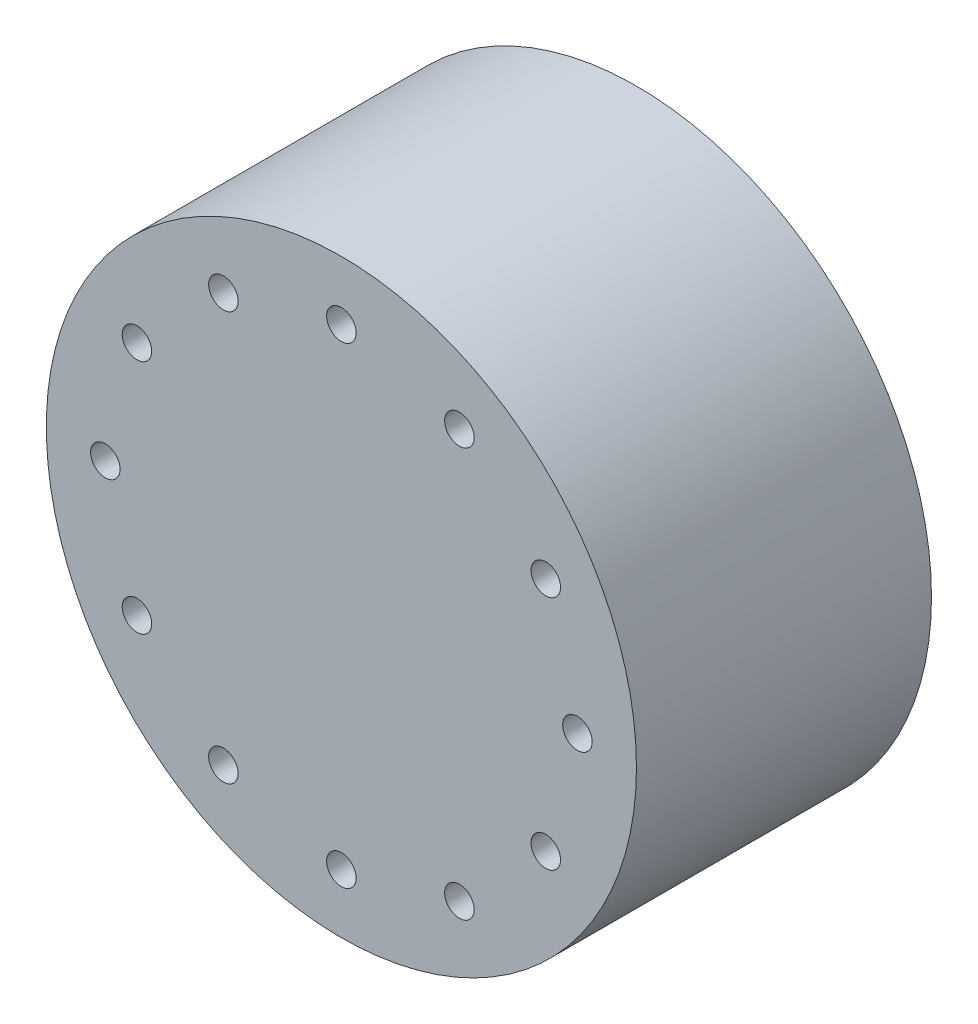
ISO-10303-21;
HEADER;
FILE_DESCRIPTION(('STEP AP214'),'2;1');
FILE_NAME('part.step','',(''),(''),'','','');
FILE_SCHEMA(('AUTOMOTIVE_DESIGN { 1 0 10303 214 1 1 1 1 }'));
ENDSEC;
DATA;
#1=APPLICATION_CONTEXT('core data for automotive mechanical design processes');
#2=APPLICATION_PROTOCOL_DEFINITION('international standard','automotive_design',2000,#1);
#3=PRODUCT_CONTEXT('',#1,'mechanical');
#4=PRODUCT('Part','Part','',(#3));
#5=PRODUCT_RELATED_PRODUCT_CATEGORY('part','',(#4));
#6=PRODUCT_DEFINITION_FORMATION('','',#4);
#7=PRODUCT_DEFINITION_CONTEXT('part definition',#1,'design');
#8=PRODUCT_DEFINITION('design','',#6,#7);
#9=PRODUCT_DEFINITION_SHAPE('','',#8);
#10=(LENGTH_UNIT() NAMED_UNIT(*) SI_UNIT(.MILLI.,.METRE.));
#11=(NAMED_UNIT(*) PLANE_ANGLE_UNIT() SI_UNIT($,.RADIAN.));
#12=(NAMED_UNIT(*) SI_UNIT($,.STERADIAN.) SOLID_ANGLE_UNIT());
#13=UNCERTAINTY_MEASURE_WITH_UNIT(LENGTH_MEASURE(1.E-05),#10,'distance_accuracy_value','');
#14=(GEOMETRIC_REPRESENTATION_CONTEXT(3) GLOBAL_UNCERTAINTY_ASSIGNED_CONTEXT((#13)) GLOBAL_UNIT_ASSIGNED_CONTEXT((#10,
#11,#12)) REPRESENTATION_CONTEXT('',''));
#15=CARTESIAN_POINT('',(0.,0.,0.));
#16=DIRECTION('',(0.,0.,1.));
#17=DIRECTION('',(1.,0.,0.));
#18=AXIS2_PLACEMENT_3D('',#15,#16,#17);
#19=CARTESIAN_POINT('',(0.,0.,5.));
#20=DIRECTION('',(0.,0.,-1.));
#21=DIRECTION('',(-1.,0.,0.));
#22=AXIS2_PLACEMENT_3D('',#19,#20,#21);
#23=CYLINDRICAL_SURFACE('',#22,5.);
#24=CARTESIAN_POINT('',(0.,0.,5.));
#25=DIRECTION('',(0.,0.,1.));
#26=DIRECTION('',(1.,0.,0.));
#27=AXIS2_PLACEMENT_3D('',#24,#25,#26);
#28=CIRCLE('',#27,5.);
#29=CARTESIAN_POINT('',(5.,0.,5.));
#30=VERTEX_POINT('',#29);
#31=EDGE_CURVE('E10',#30,#30,#28,.T.);
#32=ORIENTED_EDGE('',*,*,#31,.F.);
#33=EDGE_LOOP('',(#32));
#34=FACE_BOUND('',#33,.T.);
#35=CARTESIAN_POINT('',(0.,0.,0.));
#36=DIRECTION('',(0.,0.,1.));
#37=DIRECTION('',(1.,0.,0.));
#38=AXIS2_PLACEMENT_3D('',#35,#36,#37);
#39=CIRCLE('',#38,5.);
#40=CARTESIAN_POINT('',(5.,0.,0.));
#41=VERTEX_POINT('',#40);
#42=EDGE_CURVE('E36',#41,#41,#39,.T.);
#43=ORIENTED_EDGE('',*,*,#42,.T.);
#44=EDGE_LOOP('',(#43));
#45=FACE_BOUND('',#44,.T.);
#46=ADVANCED_FACE('F33',(#34,#45),#23,.T.);
#47=CARTESIAN_POINT('',(0.,0.,5.));
#48=DIRECTION('',(0.,0.,1.));
#49=DIRECTION('',(1.,0.,0.));
#50=AXIS2_PLACEMENT_3D('',#47,#48,#49);
#51=PLANE('',#50);
#52=CARTESIAN_POINT('',(3.46410161513778,1.99999999999996,5.));
#53=DIRECTION('',(0.,0.,1.));
#54=DIRECTION('',(0.866025403784445,0.499999999999989,0.));
#55=AXIS2_PLACEMENT_3D('',#52,#53,#54);
#56=CIRCLE('',#55,0.25);
#57=CARTESIAN_POINT('',(3.68060796608389,2.12499999999995,5.));
#58=VERTEX_POINT('',#57);
#59=EDGE_CURVE('E111',#58,#58,#56,.T.);
#60=ORIENTED_EDGE('',*,*,#59,.F.);
#61=EDGE_LOOP('',(#60));
#62=FACE_BOUND('',#61,.T.);
#63=CARTESIAN_POINT('',(2.00000000000004,3.46410161513773,5.));
#64=DIRECTION('',(0.,0.,1.));
#65=DIRECTION('',(0.50000000000001,0.866025403784433,0.));
#66=AXIS2_PLACEMENT_3D('',#63,#64,#65);
#67=CIRCLE('',#66,0.25);
#68=CARTESIAN_POINT('',(2.12500000000004,3.68060796608384,5.));
#69=VERTEX_POINT('',#68);
#70=EDGE_CURVE('E105',#69,#69,#67,.T.);
#71=ORIENTED_EDGE('',*,*,#70,.F.);
#72=EDGE_LOOP('',(#71));
#73=FACE_BOUND('',#72,.T.);
#74=CARTESIAN_POINT('',(0.,4.,5.));
#75=DIRECTION('',(0.,0.,1.));
#76=DIRECTION('',(0.,1.,0.));
#77=AXIS2_PLACEMENT_3D('',#74,#75,#76);
#78=CIRCLE('',#77,0.25);
#79=CARTESIAN_POINT('',(0.,4.25,5.));
#80=VERTEX_POINT('',#79);
#81=EDGE_CURVE('E99',#80,#80,#78,.T.);
#82=ORIENTED_EDGE('',*,*,#81,.F.);
#83=EDGE_LOOP('',(#82));
#84=FACE_BOUND('',#83,.T.);
#85=CARTESIAN_POINT('',(-1.99999999999997,3.46410161513777,5.));
#86=DIRECTION('',(0.,0.,1.));
#87=DIRECTION('',(-0.499999999999992,0.866025403784443,0.));
#88=AXIS2_PLACEMENT_3D('',#85,#86,#87);
#89=CIRCLE('',#88,0.25);
#90=CARTESIAN_POINT('',(-2.12499999999997,3.68060796608388,5.));
#91=VERTEX_POINT('',#90);
#92=EDGE_CURVE('E93',#91,#91,#89,.T.);
#93=ORIENTED_EDGE('',*,*,#92,.F.);
#94=EDGE_LOOP('',(#93));
#95=FACE_BOUND('',#94,.T.);
#96=CARTESIAN_POINT('',(-3.46410161513774,2.00000000000003,5.));
#97=DIRECTION('',(0.,0.,1.));
#98=DIRECTION('',(-0.866025403784435,0.500000000000007,0.));
#99=AXIS2_PLACEMENT_3D('',#96,#97,#98);
#100=CIRCLE('',#99,0.25);
#101=CARTESIAN_POINT('',(-3.68060796608385,2.12500000000003,5.));
#102=VERTEX_POINT('',#101);
#103=EDGE_CURVE('E87',#102,#102,#100,.T.);
#104=ORIENTED_EDGE('',*,*,#103,.F.);
#105=EDGE_LOOP('',(#104));
#106=FACE_BOUND('',#105,.T.);
#107=CARTESIAN_POINT('',(-4.,0.,5.));
#108=DIRECTION('',(0.,0.,1.));
#109=DIRECTION('',(-1.,0.,0.));
#110=AXIS2_PLACEMENT_3D('',#107,#108,#109);
#111=CIRCLE('',#110,0.25);
#112=CARTESIAN_POINT('',(-4.25,0.,5.));
#113=VERTEX_POINT('',#112);
#114=EDGE_CURVE('E81',#113,#113,#111,.T.);
#115=ORIENTED_EDGE('',*,*,#114,.F.);
#116=EDGE_LOOP('',(#115));
#117=FACE_BOUND('',#116,.T.);
#118=CARTESIAN_POINT('',(-3.46410161513777,-1.99999999999998,5.));
#119=DIRECTION('',(0.,0.,1.));
#120=DIRECTION('',(-0.866025403784442,-0.499999999999995,0.));
#121=AXIS2_PLACEMENT_3D('',#118,#119,#120);
#122=CIRCLE('',#121,0.25);
#123=CARTESIAN_POINT('',(-3.68060796608388,-2.12499999999998,5.));
#124=VERTEX_POINT('',#123);
#125=EDGE_CURVE('E75',#124,#124,#122,.T.);
#126=ORIENTED_EDGE('',*,*,#125,.F.);
#127=EDGE_LOOP('',(#126));
#128=FACE_BOUND('',#127,.T.);
#129=CARTESIAN_POINT('',(-2.00000000000002,-3.46410161513775,5.));
#130=DIRECTION('',(0.,0.,1.));
#131=DIRECTION('',(-0.500000000000004,-0.866025403784436,0.));
#132=AXIS2_PLACEMENT_3D('',#129,#130,#131);
#133=CIRCLE('',#132,0.25);
#134=CARTESIAN_POINT('',(-2.12500000000002,-3.68060796608386,5.));
#135=VERTEX_POINT('',#134);
#136=EDGE_CURVE('E69',#135,#135,#133,.T.);
#137=ORIENTED_EDGE('',*,*,#136,.F.);
#138=EDGE_LOOP('',(#137));
#139=FACE_BOUND('',#138,.T.);
#140=CARTESIAN_POINT('',(0.,-4.,5.));
#141=DIRECTION('',(0.,0.,1.));
#142=DIRECTION('',(0.,-1.,0.));
#143=AXIS2_PLACEMENT_3D('',#140,#141,#142);
#144=CIRCLE('',#143,0.25);
#145=CARTESIAN_POINT('',(0.,-4.25,5.));
#146=VERTEX_POINT('',#145);
#147=EDGE_CURVE('E63',#146,#146,#144,.T.);
#148=ORIENTED_EDGE('',*,*,#147,.F.);
#149=EDGE_LOOP('',(#148));
#150=FACE_BOUND('',#149,.T.);
#151=CARTESIAN_POINT('',(1.99999999999999,-3.46410161513776,5.));
#152=DIRECTION('',(0.,0.,1.));
#153=DIRECTION('',(0.499999999999998,-0.86602540378444,0.));
#154=AXIS2_PLACEMENT_3D('',#151,#152,#153);
#155=CIRCLE('',#154,0.25);
#156=CARTESIAN_POINT('',(2.12499999999999,-3.68060796608387,5.));
#157=VERTEX_POINT('',#156);
#158=EDGE_CURVE('E57',#157,#157,#155,.T.);
#159=ORIENTED_EDGE('',*,*,#158,.F.);
#160=EDGE_LOOP('',(#159));
#161=FACE_BOUND('',#160,.T.);
#162=CARTESIAN_POINT('',(3.46410161513775,-2.,5.));
#163=DIRECTION('',(0.,0.,1.));
#164=DIRECTION('',(0.866025403784438,-0.500000000000001,0.));
#165=AXIS2_PLACEMENT_3D('',#162,#163,#164);
#166=CIRCLE('',#165,0.25);
#167=CARTESIAN_POINT('',(3.68060796608386,-2.125,5.));
#168=VERTEX_POINT('',#167);
#169=EDGE_CURVE('E51',#168,#168,#166,.T.);
#170=ORIENTED_EDGE('',*,*,#169,.F.);
#171=EDGE_LOOP('',(#170));
#172=FACE_BOUND('',#171,.T.);
#173=CARTESIAN_POINT('',(4.,0.,5.));
#174=DIRECTION('',(0.,0.,1.));
#175=DIRECTION('',(1.,0.,0.));
#176=AXIS2_PLACEMENT_3D('',#173,#174,#175);
#177=CIRCLE('',#176,0.25);
#178=CARTESIAN_POINT('',(4.25,0.,5.));
#179=VERTEX_POINT('',#178);
#180=EDGE_CURVE('E45',#179,#179,#177,.T.);
#181=ORIENTED_EDGE('',*,*,#180,.F.);
#182=EDGE_LOOP('',(#181));
#183=FACE_BOUND('',#182,.T.);
#184=ORIENTED_EDGE('',*,*,#31,.T.);
#185=EDGE_LOOP('',(#184));
#186=FACE_BOUND('',#185,.T.);
#187=ADVANCED_FACE('F127',(#62,#73,#84,#95,#106,#117,#128,#139,#150,#161,#172,#183,#186),#51,.T.);
#188=CARTESIAN_POINT('',(0.,0.,0.));
#189=DIRECTION('',(0.,0.,1.));
#190=DIRECTION('',(1.,0.,0.));
#191=AXIS2_PLACEMENT_3D('',#188,#189,#190);
#192=PLANE('',#191);
#193=CARTESIAN_POINT('',(3.46410161513778,1.99999999999996,0.));
#194=DIRECTION('',(0.,0.,1.));
#195=DIRECTION('',(0.866025403784445,0.499999999999989,0.));
#196=AXIS2_PLACEMENT_3D('',#193,#194,#195);
#197=CIRCLE('',#196,0.25);
#198=CARTESIAN_POINT('',(3.68060796608389,2.12499999999995,0.));
#199=VERTEX_POINT('',#198);
#200=EDGE_CURVE('E108',#199,#199,#197,.T.);
#201=ORIENTED_EDGE('',*,*,#200,.T.);
#202=EDGE_LOOP('',(#201));
#203=FACE_BOUND('',#202,.T.);
#204=CARTESIAN_POINT('',(2.00000000000004,3.46410161513773,0.));
#205=DIRECTION('',(0.,0.,1.));
#206=DIRECTION('',(0.50000000000001,0.866025403784433,0.));
#207=AXIS2_PLACEMENT_3D('',#204,#205,#206);
#208=CIRCLE('',#207,0.25);
#209=CARTESIAN_POINT('',(2.12500000000004,3.68060796608384,0.));
#210=VERTEX_POINT('',#209);
#211=EDGE_CURVE('E102',#210,#210,#208,.T.);
#212=ORIENTED_EDGE('',*,*,#211,.T.);
#213=EDGE_LOOP('',(#212));
#214=FACE_BOUND('',#213,.T.);
#215=CARTESIAN_POINT('',(0.,4.,0.));
#216=DIRECTION('',(0.,0.,1.));
#217=DIRECTION('',(0.,1.,0.));
#218=AXIS2_PLACEMENT_3D('',#215,#216,#217);
#219=CIRCLE('',#218,0.25);
#220=CARTESIAN_POINT('',(0.,4.25,0.));
#221=VERTEX_POINT('',#220);
#222=EDGE_CURVE('E96',#221,#221,#219,.T.);
#223=ORIENTED_EDGE('',*,*,#222,.T.);
#224=EDGE_LOOP('',(#223));
#225=FACE_BOUND('',#224,.T.);
#226=CARTESIAN_POINT('',(-1.99999999999997,3.46410161513777,0.));
#227=DIRECTION('',(0.,0.,1.));
#228=DIRECTION('',(-0.499999999999992,0.866025403784443,0.));
#229=AXIS2_PLACEMENT_3D('',#226,#227,#228);
#230=CIRCLE('',#229,0.25);
#231=CARTESIAN_POINT('',(-2.12499999999997,3.68060796608388,0.));
#232=VERTEX_POINT('',#231);
#233=EDGE_CURVE('E90',#232,#232,#230,.T.);
#234=ORIENTED_EDGE('',*,*,#233,.T.);
#235=EDGE_LOOP('',(#234));
#236=FACE_BOUND('',#235,.T.);
#237=CARTESIAN_POINT('',(-3.46410161513774,2.00000000000003,0.));
#238=DIRECTION('',(0.,0.,1.));
#239=DIRECTION('',(-0.866025403784435,0.500000000000007,0.));
#240=AXIS2_PLACEMENT_3D('',#237,#238,#239);
#241=CIRCLE('',#240,0.25);
#242=CARTESIAN_POINT('',(-3.68060796608385,2.12500000000003,0.));
#243=VERTEX_POINT('',#242);
#244=EDGE_CURVE('E84',#243,#243,#241,.T.);
#245=ORIENTED_EDGE('',*,*,#244,.T.);
#246=EDGE_LOOP('',(#245));
#247=FACE_BOUND('',#246,.T.);
#248=CARTESIAN_POINT('',(-4.,0.,0.));
#249=DIRECTION('',(0.,0.,1.));
#250=DIRECTION('',(-1.,0.,0.));
#251=AXIS2_PLACEMENT_3D('',#248,#249,#250);
#252=CIRCLE('',#251,0.25);
#253=CARTESIAN_POINT('',(-4.25,0.,0.));
#254=VERTEX_POINT('',#253);
#255=EDGE_CURVE('E78',#254,#254,#252,.T.);
#256=ORIENTED_EDGE('',*,*,#255,.T.);
#257=EDGE_LOOP('',(#256));
#258=FACE_BOUND('',#257,.T.);
#259=CARTESIAN_POINT('',(-3.46410161513777,-1.99999999999998,0.));
#260=DIRECTION('',(0.,0.,1.));
#261=DIRECTION('',(-0.866025403784442,-0.499999999999995,0.));
#262=AXIS2_PLACEMENT_3D('',#259,#260,#261);
#263=CIRCLE('',#262,0.25);
#264=CARTESIAN_POINT('',(-3.68060796608388,-2.12499999999998,0.));
#265=VERTEX_POINT('',#264);
#266=EDGE_CURVE('E72',#265,#265,#263,.T.);
#267=ORIENTED_EDGE('',*,*,#266,.T.);
#268=EDGE_LOOP('',(#267));
#269=FACE_BOUND('',#268,.T.);
#270=CARTESIAN_POINT('',(-2.00000000000002,-3.46410161513775,0.));
#271=DIRECTION('',(0.,0.,1.));
#272=DIRECTION('',(-0.500000000000004,-0.866025403784436,0.));
#273=AXIS2_PLACEMENT_3D('',#270,#271,#272);
#274=CIRCLE('',#273,0.25);
#275=CARTESIAN_POINT('',(-2.12500000000002,-3.68060796608386,0.));
#276=VERTEX_POINT('',#275);
#277=EDGE_CURVE('E66',#276,#276,#274,.T.);
#278=ORIENTED_EDGE('',*,*,#277,.T.);
#279=EDGE_LOOP('',(#278));
#280=FACE_BOUND('',#279,.T.);
#281=CARTESIAN_POINT('',(0.,-4.,0.));
#282=DIRECTION('',(0.,0.,1.));
#283=DIRECTION('',(0.,-1.,0.));
#284=AXIS2_PLACEMENT_3D('',#281,#282,#283);
#285=CIRCLE('',#284,0.25);
#286=CARTESIAN_POINT('',(0.,-4.25,0.));
#287=VERTEX_POINT('',#286);
#288=EDGE_CURVE('E60',#287,#287,#285,.T.);
#289=ORIENTED_EDGE('',*,*,#288,.T.);
#290=EDGE_LOOP('',(#289));
#291=FACE_BOUND('',#290,.T.);
#292=CARTESIAN_POINT('',(1.99999999999999,-3.46410161513776,0.));
#293=DIRECTION('',(0.,0.,1.));
#294=DIRECTION('',(0.499999999999998,-0.86602540378444,0.));
#295=AXIS2_PLACEMENT_3D('',#292,#293,#294);
#296=CIRCLE('',#295,0.25);
#297=CARTESIAN_POINT('',(2.12499999999999,-3.68060796608387,0.));
#298=VERTEX_POINT('',#297);
#299=EDGE_CURVE('E54',#298,#298,#296,.T.);
#300=ORIENTED_EDGE('',*,*,#299,.T.);
#301=EDGE_LOOP('',(#300));
#302=FACE_BOUND('',#301,.T.);
#303=CARTESIAN_POINT('',(3.46410161513775,-2.,0.));
#304=DIRECTION('',(0.,0.,1.));
#305=DIRECTION('',(0.866025403784438,-0.500000000000001,0.));
#306=AXIS2_PLACEMENT_3D('',#303,#304,#305);
#307=CIRCLE('',#306,0.25);
#308=CARTESIAN_POINT('',(3.68060796608386,-2.125,0.));
#309=VERTEX_POINT('',#308);
#310=EDGE_CURVE('E48',#309,#309,#307,.T.);
#311=ORIENTED_EDGE('',*,*,#310,.T.);
#312=EDGE_LOOP('',(#311));
#313=FACE_BOUND('',#312,.T.);
#314=CARTESIAN_POINT('',(4.,0.,0.));
#315=DIRECTION('',(0.,0.,1.));
#316=DIRECTION('',(1.,0.,0.));
#317=AXIS2_PLACEMENT_3D('',#314,#315,#316);
#318=CIRCLE('',#317,0.25);
#319=CARTESIAN_POINT('',(4.25,0.,0.));
#320=VERTEX_POINT('',#319);
#321=EDGE_CURVE('E43',#320,#320,#318,.T.);
#322=ORIENTED_EDGE('',*,*,#321,.T.);
#323=EDGE_LOOP('',(#322));
#324=FACE_BOUND('',#323,.T.);
#325=ORIENTED_EDGE('',*,*,#42,.F.);
#326=EDGE_LOOP('',(#325));
#327=FACE_BOUND('',#326,.T.);
#328=ADVANCED_FACE('F117',(#203,#214,#225,#236,#247,#258,#269,#280,#291,#302,#313,#324,#327),
#192,.F.);
#329=CARTESIAN_POINT('',(4.,0.,0.));
#330=DIRECTION('',(0.,0.,1.));
#331=DIRECTION('',(1.,0.,0.));
#332=AXIS2_PLACEMENT_3D('',#329,#330,#331);
#333=CYLINDRICAL_SURFACE('',#332,0.25);
#334=ORIENTED_EDGE('',*,*,#321,.F.);
#335=EDGE_LOOP('',(#334));
#336=FACE_BOUND('',#335,.T.);
#337=ORIENTED_EDGE('',*,*,#180,.T.);
#338=EDGE_LOOP('',(#337));
#339=FACE_BOUND('',#338,.T.);
#340=ADVANCED_FACE('F153',(#336,#339),#333,.F.);
#341=CARTESIAN_POINT('',(3.46410161513775,-2.,0.));
#342=DIRECTION('',(0.,0.,1.));
#343=DIRECTION('',(1.,0.,0.));
#344=AXIS2_PLACEMENT_3D('',#341,#342,#343);
#345=CYLINDRICAL_SURFACE('',#344,0.25);
#346=ORIENTED_EDGE('',*,*,#310,.F.);
#347=EDGE_LOOP('',(#346));
#348=FACE_BOUND('',#347,.T.);
#349=ORIENTED_EDGE('',*,*,#169,.T.);
#350=EDGE_LOOP('',(#349));
#351=FACE_BOUND('',#350,.T.);
#352=ADVANCED_FACE('F155',(#348,#351),#345,.F.);
#353=CARTESIAN_POINT('',(1.99999999999999,-3.46410161513776,0.));
#354=DIRECTION('',(0.,0.,1.));
#355=DIRECTION('',(1.,0.,0.));
#356=AXIS2_PLACEMENT_3D('',#353,#354,#355);
#357=CYLINDRICAL_SURFACE('',#356,0.25);
#358=ORIENTED_EDGE('',*,*,#299,.F.);
#359=EDGE_LOOP('',(#358));
#360=FACE_BOUND('',#359,.T.);
#361=ORIENTED_EDGE('',*,*,#158,.T.);
#362=EDGE_LOOP('',(#361));
#363=FACE_BOUND('',#362,.T.);
#364=ADVANCED_FACE('F162',(#360,#363),#357,.F.);
#365=CARTESIAN_POINT('',(0.,-4.,0.));
#366=DIRECTION('',(0.,0.,1.));
#367=DIRECTION('',(1.,0.,0.));
#368=AXIS2_PLACEMENT_3D('',#365,#366,#367);
#369=CYLINDRICAL_SURFACE('',#368,0.25);
#370=ORIENTED_EDGE('',*,*,#288,.F.);
#371=EDGE_LOOP('',(#370));
#372=FACE_BOUND('',#371,.T.);
#373=ORIENTED_EDGE('',*,*,#147,.T.);
#374=EDGE_LOOP('',(#373));
#375=FACE_BOUND('',#374,.T.);
#376=ADVANCED_FACE('F197',(#372,#375),#369,.F.);
#377=CARTESIAN_POINT('',(-2.00000000000002,-3.46410161513775,0.));
#378=DIRECTION('',(0.,0.,1.));
#379=DIRECTION('',(1.,0.,0.));
#380=AXIS2_PLACEMENT_3D('',#377,#378,#379);
#381=CYLINDRICAL_SURFACE('',#380,0.25);
#382=ORIENTED_EDGE('',*,*,#277,.F.);
#383=EDGE_LOOP('',(#382));
#384=FACE_BOUND('',#383,.T.);
#385=ORIENTED_EDGE('',*,*,#136,.T.);
#386=EDGE_LOOP('',(#385));
#387=FACE_BOUND('',#386,.T.);
#388=ADVANCED_FACE('F207',(#384,#387),#381,.F.);
#389=CARTESIAN_POINT('',(-3.46410161513777,-1.99999999999998,0.));
#390=DIRECTION('',(0.,0.,1.));
#391=DIRECTION('',(1.,0.,0.));
#392=AXIS2_PLACEMENT_3D('',#389,#390,#391);
#393=CYLINDRICAL_SURFACE('',#392,0.25);
#394=ORIENTED_EDGE('',*,*,#266,.F.);
#395=EDGE_LOOP('',(#394));
#396=FACE_BOUND('',#395,.T.);
#397=ORIENTED_EDGE('',*,*,#125,.T.);
#398=EDGE_LOOP('',(#397));
#399=FACE_BOUND('',#398,.T.);
#400=ADVANCED_FACE('F217',(#396,#399),#393,.F.);
#401=CARTESIAN_POINT('',(-4.,0.,0.));
#402=DIRECTION('',(0.,0.,1.));
#403=DIRECTION('',(1.,0.,0.));
#404=AXIS2_PLACEMENT_3D('',#401,#402,#403);
#405=CYLINDRICAL_SURFACE('',#404,0.25);
#406=ORIENTED_EDGE('',*,*,#255,.F.);
#407=EDGE_LOOP('',(#406));
#408=FACE_BOUND('',#407,.T.);
#409=ORIENTED_EDGE('',*,*,#114,.T.);
#410=EDGE_LOOP('',(#409));
#411=FACE_BOUND('',#410,.T.);
#412=ADVANCED_FACE('F227',(#408,#411),#405,.F.);
#413=CARTESIAN_POINT('',(-3.46410161513774,2.00000000000003,0.));
#414=DIRECTION('',(0.,0.,1.));
#415=DIRECTION('',(1.,0.,0.));
#416=AXIS2_PLACEMENT_3D('',#413,#414,#415);
#417=CYLINDRICAL_SURFACE('',#416,0.25);
#418=ORIENTED_EDGE('',*,*,#244,.F.);
#419=EDGE_LOOP('',(#418));
#420=FACE_BOUND('',#419,.T.);
#421=ORIENTED_EDGE('',*,*,#103,.T.);
#422=EDGE_LOOP('',(#421));
#423=FACE_BOUND('',#422,.T.);
#424=ADVANCED_FACE('F237',(#420,#423),#417,.F.);
#425=CARTESIAN_POINT('',(-1.99999999999997,3.46410161513777,0.));
#426=DIRECTION('',(0.,0.,1.));
#427=DIRECTION('',(1.,0.,0.));
#428=AXIS2_PLACEMENT_3D('',#425,#426,#427);
#429=CYLINDRICAL_SURFACE('',#428,0.25);
#430=ORIENTED_EDGE('',*,*,#233,.F.);
#431=EDGE_LOOP('',(#430));
#432=FACE_BOUND('',#431,.T.);
#433=ORIENTED_EDGE('',*,*,#92,.T.);
#434=EDGE_LOOP('',(#433));
#435=FACE_BOUND('',#434,.T.);
#436=ADVANCED_FACE('F247',(#432,#435),#429,.F.);
#437=CARTESIAN_POINT('',(0.,4.,0.));
#438=DIRECTION('',(0.,0.,1.));
#439=DIRECTION('',(1.,0.,0.));
#440=AXIS2_PLACEMENT_3D('',#437,#438,#439);
#441=CYLINDRICAL_SURFACE('',#440,0.25);
#442=ORIENTED_EDGE('',*,*,#222,.F.);
#443=EDGE_LOOP('',(#442));
#444=FACE_BOUND('',#443,.T.);
#445=ORIENTED_EDGE('',*,*,#81,.T.);
#446=EDGE_LOOP('',(#445));
#447=FACE_BOUND('',#446,.T.);
#448=ADVANCED_FACE('F257',(#444,#447),#441,.F.);
#449=CARTESIAN_POINT('',(2.00000000000004,3.46410161513773,0.));
#450=DIRECTION('',(0.,0.,1.));
#451=DIRECTION('',(1.,0.,0.));
#452=AXIS2_PLACEMENT_3D('',#449,#450,#451);
#453=CYLINDRICAL_SURFACE('',#452,0.25);
#454=ORIENTED_EDGE('',*,*,#211,.F.);
#455=EDGE_LOOP('',(#454));
#456=FACE_BOUND('',#455,.T.);
#457=ORIENTED_EDGE('',*,*,#70,.T.);
#458=EDGE_LOOP('',(#457));
#459=FACE_BOUND('',#458,.T.);
#460=ADVANCED_FACE('F123',(#456,#459),#453,.F.);
#461=CARTESIAN_POINT('',(3.46410161513778,1.99999999999996,0.));
#462=DIRECTION('',(0.,0.,1.));
#463=DIRECTION('',(1.,0.,0.));
#464=AXIS2_PLACEMENT_3D('',#461,#462,#463);
#465=CYLINDRICAL_SURFACE('',#464,0.25);
#466=ORIENTED_EDGE('',*,*,#200,.F.);
#467=EDGE_LOOP('',(#466));
#468=FACE_BOUND('',#467,.T.);
#469=ORIENTED_EDGE('',*,*,#59,.T.);
#470=EDGE_LOOP('',(#469));
#471=FACE_BOUND('',#470,.T.);
#472=ADVANCED_FACE('F120',(#468,#471),#465,.F.);
#473=CLOSED_SHELL('',(#46,#187,#328,#340,#352,#364,#376,#388,#400,#412,#424,#436,#448,#460,#472));
#474=MANIFOLD_SOLID_BREP('B2',#473);
#475=ADVANCED_BREP_SHAPE_REPRESENTATION('',(#18,#474),#14);
#476=SHAPE_DEFINITION_REPRESENTATION(#9,#475);
ENDSEC;
END-ISO-10303-21;
